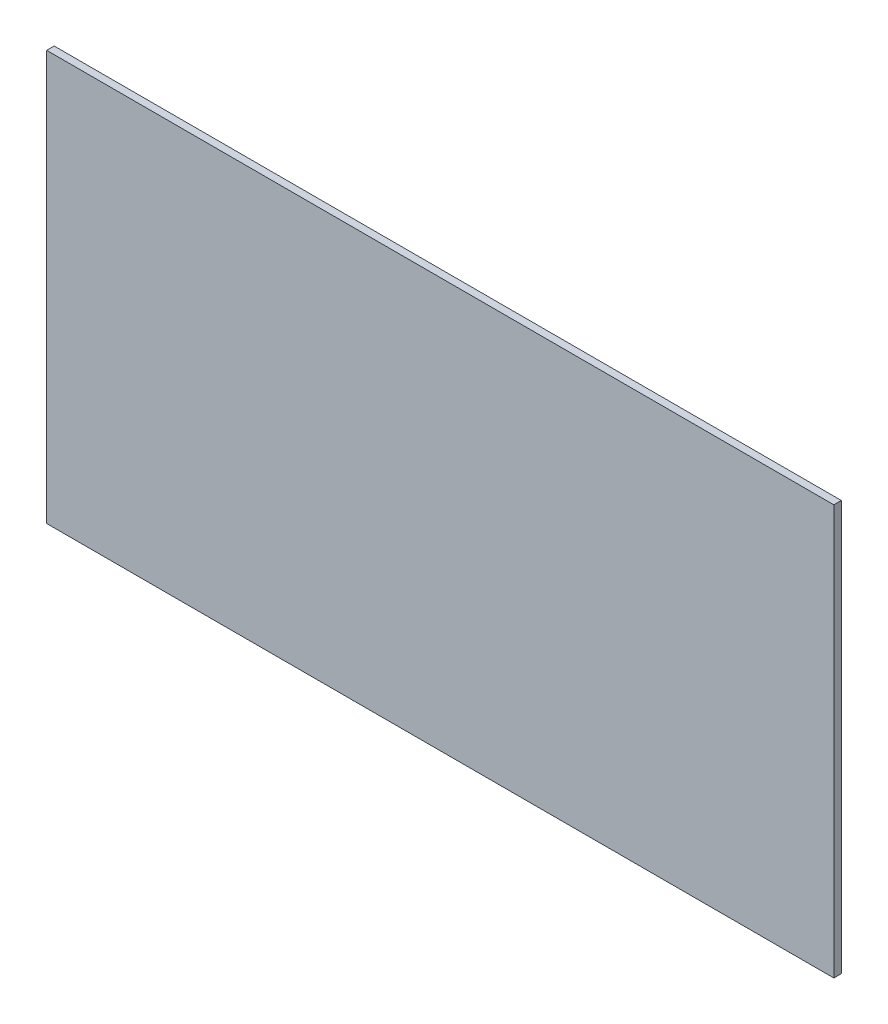
ISO-10303-21;
HEADER;
FILE_DESCRIPTION(('STEP AP214'),'2;1');
FILE_NAME('part.step','',(''),(''),'','','');
FILE_SCHEMA(('AUTOMOTIVE_DESIGN { 1 0 10303 214 1 1 1 1 }'));
ENDSEC;
DATA;
#1=APPLICATION_CONTEXT('core data for automotive mechanical design processes');
#2=APPLICATION_PROTOCOL_DEFINITION('international standard','automotive_design',2000,#1);
#3=PRODUCT_CONTEXT('',#1,'mechanical');
#4=PRODUCT('Part','Part','',(#3));
#5=PRODUCT_RELATED_PRODUCT_CATEGORY('part','',(#4));
#6=PRODUCT_DEFINITION_FORMATION('','',#4);
#7=PRODUCT_DEFINITION_CONTEXT('part definition',#1,'design');
#8=PRODUCT_DEFINITION('design','',#6,#7);
#9=PRODUCT_DEFINITION_SHAPE('','',#8);
#10=(LENGTH_UNIT() NAMED_UNIT(*) SI_UNIT(.MILLI.,.METRE.));
#11=(NAMED_UNIT(*) PLANE_ANGLE_UNIT() SI_UNIT($,.RADIAN.));
#12=(NAMED_UNIT(*) SI_UNIT($,.STERADIAN.) SOLID_ANGLE_UNIT());
#13=UNCERTAINTY_MEASURE_WITH_UNIT(LENGTH_MEASURE(1.E-05),#10,'distance_accuracy_value','');
#14=(GEOMETRIC_REPRESENTATION_CONTEXT(3) GLOBAL_UNCERTAINTY_ASSIGNED_CONTEXT((#13)) GLOBAL_UNIT_ASSIGNED_CONTEXT((#10,
#11,#12)) REPRESENTATION_CONTEXT('',''));
#15=CARTESIAN_POINT('',(0.,0.,0.));
#16=DIRECTION('',(0.,0.,1.));
#17=DIRECTION('',(1.,0.,0.));
#18=AXIS2_PLACEMENT_3D('',#15,#16,#17);
#19=CARTESIAN_POINT('',(0.,0.,-6.));
#20=DIRECTION('',(-1.,0.,0.));
#21=DIRECTION('',(0.,-1.,0.));
#22=AXIS2_PLACEMENT_3D('',#19,#20,#21);
#23=PLANE('',#22);
#24=DIRECTION('',(0.,-1.,0.));
#25=VECTOR('',#24,1.);
#26=CARTESIAN_POINT('',(0.,0.,0.));
#27=LINE('',#26,#25);
#28=CARTESIAN_POINT('',(0.,0.,0.));
#29=VERTEX_POINT('',#28);
#30=CARTESIAN_POINT('',(0.,-328.,0.));
#31=VERTEX_POINT('',#30);
#32=EDGE_CURVE('E102',#29,#31,#27,.T.);
#33=ORIENTED_EDGE('',*,*,#32,.F.);
#34=DIRECTION('',(0.,0.,1.));
#35=VECTOR('',#34,1.);
#36=CARTESIAN_POINT('',(0.,0.,-6.));
#37=LINE('',#36,#35);
#38=CARTESIAN_POINT('',(0.,0.,-6.));
#39=VERTEX_POINT('',#38);
#40=EDGE_CURVE('E11',#39,#29,#37,.T.);
#41=ORIENTED_EDGE('',*,*,#40,.F.);
#42=DIRECTION('',(0.,-1.,0.));
#43=VECTOR('',#42,1.);
#44=CARTESIAN_POINT('',(0.,0.,-6.));
#45=LINE('',#44,#43);
#46=CARTESIAN_POINT('',(0.,-328.,-6.));
#47=VERTEX_POINT('',#46);
#48=EDGE_CURVE('E96',#39,#47,#45,.T.);
#49=ORIENTED_EDGE('',*,*,#48,.T.);
#50=DIRECTION('',(0.,0.,1.));
#51=VECTOR('',#50,1.);
#52=CARTESIAN_POINT('',(0.,-328.,-6.));
#53=LINE('',#52,#51);
#54=EDGE_CURVE('E41',#47,#31,#53,.T.);
#55=ORIENTED_EDGE('',*,*,#54,.T.);
#56=EDGE_LOOP('',(#33,#41,#49,#55));
#57=FACE_BOUND('',#56,.T.);
#58=ADVANCED_FACE('F38',(#57),#23,.T.);
#59=CARTESIAN_POINT('',(0.,0.,-6.));
#60=DIRECTION('',(0.,1.,0.));
#61=DIRECTION('',(0.,0.,1.));
#62=AXIS2_PLACEMENT_3D('',#59,#60,#61);
#63=PLANE('',#62);
#64=DIRECTION('',(-1.,0.,0.));
#65=VECTOR('',#64,1.);
#66=CARTESIAN_POINT('',(0.,0.,0.));
#67=LINE('',#66,#65);
#68=CARTESIAN_POINT('',(630.,0.,0.));
#69=VERTEX_POINT('',#68);
#70=EDGE_CURVE('E98',#69,#29,#67,.T.);
#71=ORIENTED_EDGE('',*,*,#70,.F.);
#72=DIRECTION('',(0.,0.,1.));
#73=VECTOR('',#72,1.);
#74=CARTESIAN_POINT('',(630.,0.,-6.));
#75=LINE('',#74,#73);
#76=CARTESIAN_POINT('',(630.,0.,-6.));
#77=VERTEX_POINT('',#76);
#78=EDGE_CURVE('E47',#77,#69,#75,.T.);
#79=ORIENTED_EDGE('',*,*,#78,.F.);
#80=DIRECTION('',(-1.,0.,0.));
#81=VECTOR('',#80,1.);
#82=CARTESIAN_POINT('',(0.,0.,-6.));
#83=LINE('',#82,#81);
#84=EDGE_CURVE('E93',#77,#39,#83,.T.);
#85=ORIENTED_EDGE('',*,*,#84,.T.);
#86=ORIENTED_EDGE('',*,*,#40,.T.);
#87=EDGE_LOOP('',(#71,#79,#85,#86));
#88=FACE_BOUND('',#87,.T.);
#89=ADVANCED_FACE('F112',(#88),#63,.T.);
#90=CARTESIAN_POINT('',(630.,0.,-6.));
#91=DIRECTION('',(1.,0.,0.));
#92=DIRECTION('',(0.,0.,-1.));
#93=AXIS2_PLACEMENT_3D('',#90,#91,#92);
#94=PLANE('',#93);
#95=DIRECTION('',(0.,1.,0.));
#96=VECTOR('',#95,1.);
#97=CARTESIAN_POINT('',(630.,0.,0.));
#98=LINE('',#97,#96);
#99=CARTESIAN_POINT('',(630.,-328.,0.));
#100=VERTEX_POINT('',#99);
#101=EDGE_CURVE('E88',#100,#69,#98,.T.);
#102=ORIENTED_EDGE('',*,*,#101,.F.);
#103=DIRECTION('',(0.,0.,1.));
#104=VECTOR('',#103,1.);
#105=CARTESIAN_POINT('',(630.,-328.,-6.));
#106=LINE('',#105,#104);
#107=CARTESIAN_POINT('',(630.,-328.,-6.));
#108=VERTEX_POINT('',#107);
#109=EDGE_CURVE('E83',#108,#100,#106,.T.);
#110=ORIENTED_EDGE('',*,*,#109,.F.);
#111=DIRECTION('',(0.,1.,0.));
#112=VECTOR('',#111,1.);
#113=CARTESIAN_POINT('',(630.,0.,-6.));
#114=LINE('',#113,#112);
#115=EDGE_CURVE('E86',#108,#77,#114,.T.);
#116=ORIENTED_EDGE('',*,*,#115,.T.);
#117=ORIENTED_EDGE('',*,*,#78,.T.);
#118=EDGE_LOOP('',(#102,#110,#116,#117));
#119=FACE_BOUND('',#118,.T.);
#120=ADVANCED_FACE('F85',(#119),#94,.T.);
#121=CARTESIAN_POINT('',(0.,-328.,-6.));
#122=DIRECTION('',(0.,-1.,0.));
#123=DIRECTION('',(0.,0.,-1.));
#124=AXIS2_PLACEMENT_3D('',#121,#122,#123);
#125=PLANE('',#124);
#126=DIRECTION('',(1.,0.,0.));
#127=VECTOR('',#126,1.);
#128=CARTESIAN_POINT('',(0.,-328.,0.));
#129=LINE('',#128,#127);
#130=EDGE_CURVE('E105',#31,#100,#129,.T.);
#131=ORIENTED_EDGE('',*,*,#130,.F.);
#132=ORIENTED_EDGE('',*,*,#54,.F.);
#133=DIRECTION('',(1.,0.,0.));
#134=VECTOR('',#133,1.);
#135=CARTESIAN_POINT('',(0.,-328.,-6.));
#136=LINE('',#135,#134);
#137=EDGE_CURVE('E92',#47,#108,#136,.T.);
#138=ORIENTED_EDGE('',*,*,#137,.T.);
#139=ORIENTED_EDGE('',*,*,#109,.T.);
#140=EDGE_LOOP('',(#131,#132,#138,#139));
#141=FACE_BOUND('',#140,.T.);
#142=ADVANCED_FACE('F95',(#141),#125,.T.);
#143=CARTESIAN_POINT('',(0.,0.,-6.));
#144=DIRECTION('',(0.,0.,1.));
#145=DIRECTION('',(1.,0.,0.));
#146=AXIS2_PLACEMENT_3D('',#143,#144,#145);
#147=PLANE('',#146);
#148=ORIENTED_EDGE('',*,*,#48,.F.);
#149=ORIENTED_EDGE('',*,*,#84,.F.);
#150=ORIENTED_EDGE('',*,*,#115,.F.);
#151=ORIENTED_EDGE('',*,*,#137,.F.);
#152=EDGE_LOOP('',(#148,#149,#150,#151));
#153=FACE_BOUND('',#152,.T.);
#154=ADVANCED_FACE('F91',(#153),#147,.F.);
#155=CARTESIAN_POINT('',(0.,0.,0.));
#156=DIRECTION('',(0.,0.,1.));
#157=DIRECTION('',(1.,0.,0.));
#158=AXIS2_PLACEMENT_3D('',#155,#156,#157);
#159=PLANE('',#158);
#160=ORIENTED_EDGE('',*,*,#32,.T.);
#161=ORIENTED_EDGE('',*,*,#130,.T.);
#162=ORIENTED_EDGE('',*,*,#101,.T.);
#163=ORIENTED_EDGE('',*,*,#70,.T.);
#164=EDGE_LOOP('',(#160,#161,#162,#163));
#165=FACE_BOUND('',#164,.T.);
#166=ADVANCED_FACE('F111',(#165),#159,.T.);
#167=CLOSED_SHELL('',(#58,#89,#120,#142,#154,#166));
#168=MANIFOLD_SOLID_BREP('B2',#167);
#169=ADVANCED_BREP_SHAPE_REPRESENTATION('',(#18,#168),#14);
#170=SHAPE_DEFINITION_REPRESENTATION(#9,#169);
ENDSEC;
END-ISO-10303-21;
